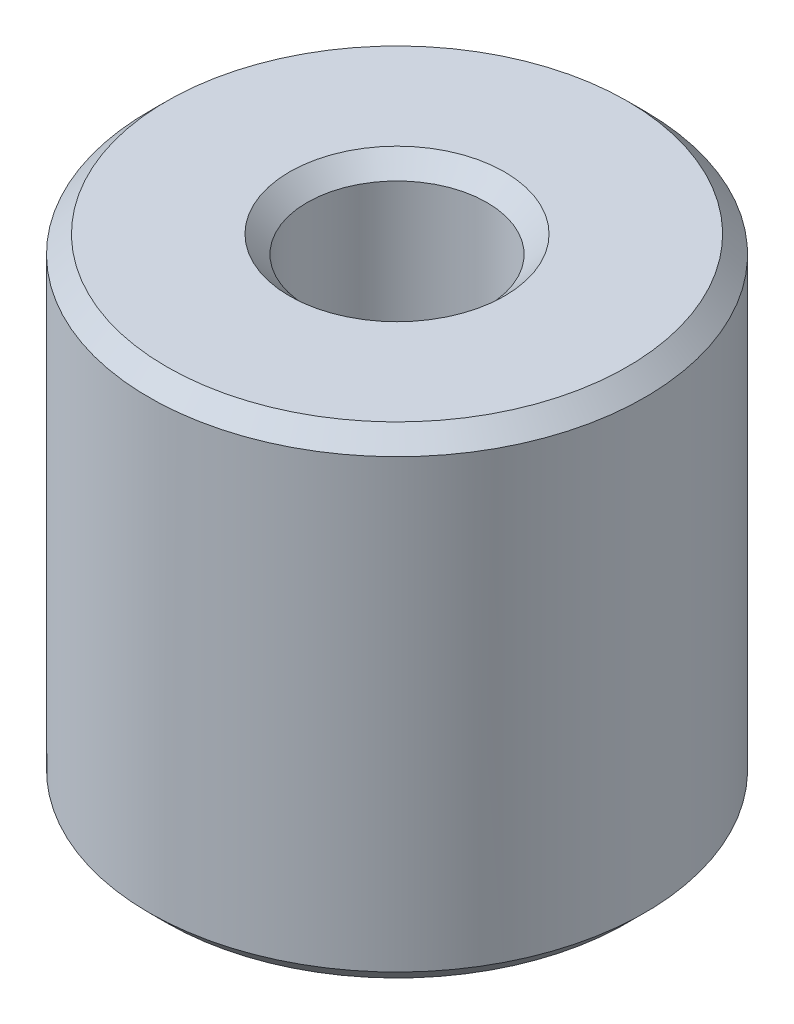
ISO-10303-21;
HEADER;
FILE_DESCRIPTION(('STEP AP214'),'2;1');
FILE_NAME('part.step','',(''),(''),'','','');
FILE_SCHEMA(('AUTOMOTIVE_DESIGN { 1 0 10303 214 1 1 1 1 }'));
ENDSEC;
DATA;
#1=APPLICATION_CONTEXT('core data for automotive mechanical design processes');
#2=APPLICATION_PROTOCOL_DEFINITION('international standard','automotive_design',2000,#1);
#3=PRODUCT_CONTEXT('',#1,'mechanical');
#4=PRODUCT('Part','Part','',(#3));
#5=PRODUCT_RELATED_PRODUCT_CATEGORY('part','',(#4));
#6=PRODUCT_DEFINITION_FORMATION('','',#4);
#7=PRODUCT_DEFINITION_CONTEXT('part definition',#1,'design');
#8=PRODUCT_DEFINITION('design','',#6,#7);
#9=PRODUCT_DEFINITION_SHAPE('','',#8);
#10=(LENGTH_UNIT() NAMED_UNIT(*) SI_UNIT(.MILLI.,.METRE.));
#11=(NAMED_UNIT(*) PLANE_ANGLE_UNIT() SI_UNIT($,.RADIAN.));
#12=(NAMED_UNIT(*) SI_UNIT($,.STERADIAN.) SOLID_ANGLE_UNIT());
#13=UNCERTAINTY_MEASURE_WITH_UNIT(LENGTH_MEASURE(1.E-05),#10,'distance_accuracy_value','');
#14=(GEOMETRIC_REPRESENTATION_CONTEXT(3) GLOBAL_UNCERTAINTY_ASSIGNED_CONTEXT((#13)) GLOBAL_UNIT_ASSIGNED_CONTEXT((#10,
#11,#12)) REPRESENTATION_CONTEXT('',''));
#15=CARTESIAN_POINT('',(0.,0.,0.));
#16=DIRECTION('',(0.,0.,1.));
#17=DIRECTION('',(1.,0.,0.));
#18=AXIS2_PLACEMENT_3D('',#15,#16,#17);
#19=CARTESIAN_POINT('',(0.,29.1415438561672,0.));
#20=DIRECTION('',(0.,-1.,0.));
#21=DIRECTION('',(0.,0.,-1.));
#22=AXIS2_PLACEMENT_3D('',#19,#20,#21);
#23=CYLINDRICAL_SURFACE('',#22,15.);
#24=CARTESIAN_POINT('',(0.,1.06807664097144,0.));
#25=DIRECTION('',(0.,1.,0.));
#26=DIRECTION('',(0.,0.,1.));
#27=AXIS2_PLACEMENT_3D('',#24,#25,#26);
#28=CIRCLE('',#27,15.);
#29=CARTESIAN_POINT('',(0.,1.06807664097144,-15.));
#30=VERTEX_POINT('',#29);
#31=EDGE_CURVE('E10',#30,#30,#28,.T.);
#32=CARTESIAN_POINT('',(0.,28.0734672151958,0.));
#33=DIRECTION('',(0.,1.,0.));
#34=DIRECTION('',(0.,0.,1.));
#35=AXIS2_PLACEMENT_3D('',#32,#33,#34);
#36=CIRCLE('',#35,15.);
#37=CARTESIAN_POINT('',(0.,28.0734672151958,-15.));
#38=VERTEX_POINT('',#37);
#39=EDGE_CURVE('E50',#38,#38,#36,.F.);
#40=CARTESIAN_POINT('',(0.,1.06807664097144,-15.));
#41=CARTESIAN_POINT('',(0.,1.34938279278628,-15.));
#42=CARTESIAN_POINT('',(0.,1.63068894460111,-15.));
#43=CARTESIAN_POINT('',(0.,2.19330124823079,-15.));
#44=CARTESIAN_POINT('',(0.,2.47460740004563,-15.));
#45=CARTESIAN_POINT('',(0.,3.0372197036753,-15.));
#46=CARTESIAN_POINT('',(0.,3.31852585549014,-15.));
#47=CARTESIAN_POINT('',(0.,3.88113815911981,-15.));
#48=CARTESIAN_POINT('',(0.,4.16244431093465,-15.));
#49=CARTESIAN_POINT('',(0.,4.72505661456433,-15.));
#50=CARTESIAN_POINT('',(0.,5.00636276637916,-15.));
#51=CARTESIAN_POINT('',(0.,5.56897507000884,-15.));
#52=CARTESIAN_POINT('',(0.,5.85028122182368,-15.));
#53=CARTESIAN_POINT('',(0.,6.41289352545335,-15.));
#54=CARTESIAN_POINT('',(0.,6.69419967726819,-15.));
#55=CARTESIAN_POINT('',(0.,7.25681198089786,-15.));
#56=CARTESIAN_POINT('',(0.,7.5381181327127,-15.));
#57=CARTESIAN_POINT('',(0.,8.10073043634238,-15.));
#58=CARTESIAN_POINT('',(0.,8.38203658815721,-15.));
#59=CARTESIAN_POINT('',(0.,8.94464889178689,-15.));
#60=CARTESIAN_POINT('',(0.,9.22595504360173,-15.));
#61=CARTESIAN_POINT('',(0.,9.7885673472314,-15.));
#62=CARTESIAN_POINT('',(0.,10.0698734990462,-15.));
#63=CARTESIAN_POINT('',(0.,10.6324858026759,-15.));
#64=CARTESIAN_POINT('',(0.,10.9137919544908,-15.));
#65=CARTESIAN_POINT('',(0.,11.4764042581204,-15.));
#66=CARTESIAN_POINT('',(0.,11.7577104099353,-15.));
#67=CARTESIAN_POINT('',(0.,12.3203227135649,-15.));
#68=CARTESIAN_POINT('',(0.,12.6016288653798,-15.));
#69=CARTESIAN_POINT('',(0.,13.1642411690095,-15.));
#70=CARTESIAN_POINT('',(0.,13.4455473208243,-15.));
#71=CARTESIAN_POINT('',(0.,14.008159624454,-15.));
#72=CARTESIAN_POINT('',(0.,14.2894657762688,-15.));
#73=CARTESIAN_POINT('',(0.,14.8520780798985,-15.));
#74=CARTESIAN_POINT('',(0.,15.1333842317133,-15.));
#75=CARTESIAN_POINT('',(0.,15.695996535343,-15.));
#76=CARTESIAN_POINT('',(0.,15.9773026871578,-15.));
#77=CARTESIAN_POINT('',(0.,16.5399149907875,-15.));
#78=CARTESIAN_POINT('',(0.,16.8212211426023,-15.));
#79=CARTESIAN_POINT('',(0.,17.383833446232,-15.));
#80=CARTESIAN_POINT('',(0.,17.6651395980469,-15.));
#81=CARTESIAN_POINT('',(0.,18.2277519016765,-15.));
#82=CARTESIAN_POINT('',(0.,18.5090580534914,-15.));
#83=CARTESIAN_POINT('',(0.,19.071670357121,-15.));
#84=CARTESIAN_POINT('',(0.,19.3529765089359,-15.));
#85=CARTESIAN_POINT('',(0.,19.9155888125656,-15.));
#86=CARTESIAN_POINT('',(0.,20.1968949643804,-15.));
#87=CARTESIAN_POINT('',(0.,20.7595072680101,-15.));
#88=CARTESIAN_POINT('',(0.,21.0408134198249,-15.));
#89=CARTESIAN_POINT('',(0.,21.6034257234546,-15.));
#90=CARTESIAN_POINT('',(0.,21.8847318752694,-15.));
#91=CARTESIAN_POINT('',(0.,22.4473441788991,-15.));
#92=CARTESIAN_POINT('',(0.,22.7286503307139,-15.));
#93=CARTESIAN_POINT('',(0.,23.2912626343436,-15.));
#94=CARTESIAN_POINT('',(0.,23.5725687861584,-15.));
#95=CARTESIAN_POINT('',(0.,24.1351810897881,-15.));
#96=CARTESIAN_POINT('',(0.,24.416487241603,-15.));
#97=CARTESIAN_POINT('',(0.,24.9790995452326,-15.));
#98=CARTESIAN_POINT('',(0.,25.2604056970475,-15.));
#99=CARTESIAN_POINT('',(0.,25.8230180006771,-15.));
#100=CARTESIAN_POINT('',(0.,26.104324152492,-15.));
#101=CARTESIAN_POINT('',(0.,26.6669364561217,-15.));
#102=CARTESIAN_POINT('',(0.,26.9482426079365,-15.));
#103=CARTESIAN_POINT('',(0.,27.5108549115662,-15.));
#104=CARTESIAN_POINT('',(0.,27.792161063381,-15.));
#105=CARTESIAN_POINT('',(0.,28.0734672151958,-15.));
#106=B_SPLINE_CURVE_WITH_KNOTS('',3,(#40,#41,#42,#43,#44,#45,#46,#47,#48,#49,#50,#51,#52,#53,
#54,#55,#56,#57,#58,#59,#60,#61,#62,#63,#64,#65,#66,#67,#68,#69,#70,#71,#72,#73,#74,#75,#76,#77,
#78,#79,#80,#81,#82,#83,#84,#85,#86,#87,#88,#89,#90,#91,#92,#93,#94,#95,#96,#97,#98,#99,#100,
#101,#102,#103,#104,#105),.UNSPECIFIED.,.F.,.F.,(4,2,2,2,2,2,2,2,2,2,2,2,2,2,2,2,2,2,2,2,2,2,2,
2,2,2,2,2,2,2,2,2,4),(0.,0.843918455444514,1.68783691088903,2.53175536633354,3.37567382177805,
4.21959227722257,5.06351073266708,5.90742918811159,6.7513476435561,7.59526609900062,
8.43918455444513,9.28310300988964,10.1270214653342,10.9709399207787,11.8148583762232,
12.6587768316677,13.5026952871122,14.3466137425567,15.1905321980012,16.0344506534457,
16.8783691088903,17.7222875643348,18.5662060197793,19.4101244752238,20.2540429306683,
21.0979613861128,21.9418798415573,22.7857982970018,23.6297167524464,24.4736352078909,
25.3175536633354,26.1614721187799,27.0053905742244),.UNSPECIFIED.);
#107=EDGE_CURVE('BSEAM39',#30,#38,#106,.T.);
#108=ORIENTED_EDGE('',*,*,#31,.T.);
#109=ORIENTED_EDGE('',*,*,#39,.T.);
#110=ORIENTED_EDGE('',*,*,#107,.T.);
#111=ORIENTED_EDGE('',*,*,#107,.F.);
#112=EDGE_LOOP('',(#108,#110,#109,#111));
#113=FACE_BOUND('',#112,.T.);
#114=ADVANCED_FACE('F39',(#113),#23,.T.);
#115=CARTESIAN_POINT('',(0.,29.1415438561672,0.));
#116=DIRECTION('',(0.,1.,0.));
#117=DIRECTION('',(0.,0.,1.));
#118=AXIS2_PLACEMENT_3D('',#115,#116,#117);
#119=PLANE('',#118);
#120=CARTESIAN_POINT('',(0.,29.1415438561672,0.));
#121=DIRECTION('',(0.,1.,0.));
#122=DIRECTION('',(0.,0.,1.));
#123=AXIS2_PLACEMENT_3D('',#120,#121,#122);
#124=CIRCLE('',#123,6.507497759652);
#125=CARTESIAN_POINT('',(0.,29.1415438561672,6.507497759652));
#126=VERTEX_POINT('',#125);
#127=EDGE_CURVE('E58',#126,#126,#124,.F.);
#128=ORIENTED_EDGE('',*,*,#127,.T.);
#129=EDGE_LOOP('',(#128));
#130=FACE_BOUND('',#129,.T.);
#131=CARTESIAN_POINT('',(0.,29.1415438561672,0.));
#132=DIRECTION('',(0.,1.,0.));
#133=DIRECTION('',(0.,0.,1.));
#134=AXIS2_PLACEMENT_3D('',#131,#132,#133);
#135=CIRCLE('',#134,13.9319233590286);
#136=CARTESIAN_POINT('',(0.,29.1415438561672,13.9319233590286));
#137=VERTEX_POINT('',#136);
#138=EDGE_CURVE('E61',#137,#137,#135,.T.);
#139=ORIENTED_EDGE('',*,*,#138,.T.);
#140=EDGE_LOOP('',(#139));
#141=FACE_BOUND('',#140,.T.);
#142=ADVANCED_FACE('F88',(#130,#141),#119,.T.);
#143=CARTESIAN_POINT('',(0.,0.,0.));
#144=DIRECTION('',(0.,1.,0.));
#145=DIRECTION('',(0.,0.,1.));
#146=AXIS2_PLACEMENT_3D('',#143,#144,#145);
#147=PLANE('',#146);
#148=CARTESIAN_POINT('',(0.,0.,0.));
#149=DIRECTION('',(0.,1.,0.));
#150=DIRECTION('',(0.,0.,1.));
#151=AXIS2_PLACEMENT_3D('',#148,#149,#150);
#152=CIRCLE('',#151,6.50749775965196);
#153=CARTESIAN_POINT('',(0.,0.,6.50749775965196));
#154=VERTEX_POINT('',#153);
#155=EDGE_CURVE('E51',#154,#154,#152,.T.);
#156=ORIENTED_EDGE('',*,*,#155,.T.);
#157=EDGE_LOOP('',(#156));
#158=FACE_BOUND('',#157,.T.);
#159=CARTESIAN_POINT('',(0.,0.,0.));
#160=DIRECTION('',(0.,1.,0.));
#161=DIRECTION('',(0.,0.,1.));
#162=AXIS2_PLACEMENT_3D('',#159,#160,#161);
#163=CIRCLE('',#162,13.9319233590286);
#164=CARTESIAN_POINT('',(0.,0.,13.9319233590286));
#165=VERTEX_POINT('',#164);
#166=EDGE_CURVE('E54',#165,#165,#163,.F.);
#167=ORIENTED_EDGE('',*,*,#166,.T.);
#168=EDGE_LOOP('',(#167));
#169=FACE_BOUND('',#168,.T.);
#170=ADVANCED_FACE('F83',(#158,#169),#147,.F.);
#171=CARTESIAN_POINT('',(0.,29.1415438561672,0.));
#172=DIRECTION('',(0.,-1.,0.));
#173=DIRECTION('',(0.,0.,-1.));
#174=AXIS2_PLACEMENT_3D('',#171,#172,#173);
#175=CYLINDRICAL_SURFACE('',#174,5.43942111868056);
#176=CARTESIAN_POINT('',(0.,28.0734672151958,0.));
#177=DIRECTION('',(0.,1.,0.));
#178=DIRECTION('',(0.,0.,1.));
#179=AXIS2_PLACEMENT_3D('',#176,#177,#178);
#180=CIRCLE('',#179,5.43942111868056);
#181=CARTESIAN_POINT('',(0.,28.0734672151958,-5.43942111868056));
#182=VERTEX_POINT('',#181);
#183=EDGE_CURVE('E67',#182,#182,#180,.T.);
#184=CARTESIAN_POINT('',(0.,1.06807664097141,0.));
#185=DIRECTION('',(0.,1.,0.));
#186=DIRECTION('',(0.,0.,1.));
#187=AXIS2_PLACEMENT_3D('',#184,#185,#186);
#188=CIRCLE('',#187,5.43942111868056);
#189=CARTESIAN_POINT('',(0.,1.0680766409714,-5.43942111868056));
#190=VERTEX_POINT('',#189);
#191=EDGE_CURVE('E69',#190,#190,#188,.F.);
#192=CARTESIAN_POINT('',(0.,28.0734672151958,-5.43942111868056));
#193=CARTESIAN_POINT('',(0.,27.792161063381,-5.43942111868056));
#194=CARTESIAN_POINT('',(0.,27.5108549115661,-5.43942111868056));
#195=CARTESIAN_POINT('',(0.,26.9482426079365,-5.43942111868056));
#196=CARTESIAN_POINT('',(0.,26.6669364561216,-5.43942111868056));
#197=CARTESIAN_POINT('',(0.,26.104324152492,-5.43942111868056));
#198=CARTESIAN_POINT('',(0.,25.8230180006771,-5.43942111868056));
#199=CARTESIAN_POINT('',(0.,25.2604056970474,-5.43942111868056));
#200=CARTESIAN_POINT('',(0.,24.9790995452326,-5.43942111868056));
#201=CARTESIAN_POINT('',(0.,24.4164872416029,-5.43942111868056));
#202=CARTESIAN_POINT('',(0.,24.1351810897881,-5.43942111868056));
#203=CARTESIAN_POINT('',(0.,23.5725687861584,-5.43942111868056));
#204=CARTESIAN_POINT('',(0.,23.2912626343436,-5.43942111868056));
#205=CARTESIAN_POINT('',(0.,22.7286503307139,-5.43942111868056));
#206=CARTESIAN_POINT('',(0.,22.4473441788991,-5.43942111868056));
#207=CARTESIAN_POINT('',(0.,21.8847318752694,-5.43942111868056));
#208=CARTESIAN_POINT('',(0.,21.6034257234545,-5.43942111868056));
#209=CARTESIAN_POINT('',(0.,21.0408134198249,-5.43942111868056));
#210=CARTESIAN_POINT('',(0.,20.75950726801,-5.43942111868056));
#211=CARTESIAN_POINT('',(0.,20.1968949643804,-5.43942111868056));
#212=CARTESIAN_POINT('',(0.,19.9155888125655,-5.43942111868056));
#213=CARTESIAN_POINT('',(0.,19.3529765089358,-5.43942111868056));
#214=CARTESIAN_POINT('',(0.,19.071670357121,-5.43942111868056));
#215=CARTESIAN_POINT('',(0.,18.5090580534913,-5.43942111868056));
#216=CARTESIAN_POINT('',(0.,18.2277519016765,-5.43942111868056));
#217=CARTESIAN_POINT('',(0.,17.6651395980468,-5.43942111868056));
#218=CARTESIAN_POINT('',(0.,17.383833446232,-5.43942111868056));
#219=CARTESIAN_POINT('',(0.,16.8212211426023,-5.43942111868056));
#220=CARTESIAN_POINT('',(0.,16.5399149907875,-5.43942111868056));
#221=CARTESIAN_POINT('',(0.,15.9773026871578,-5.43942111868056));
#222=CARTESIAN_POINT('',(0.,15.695996535343,-5.43942111868056));
#223=CARTESIAN_POINT('',(0.,15.1333842317133,-5.43942111868056));
#224=CARTESIAN_POINT('',(0.,14.8520780798984,-5.43942111868056));
#225=CARTESIAN_POINT('',(0.,14.2894657762688,-5.43942111868056));
#226=CARTESIAN_POINT('',(0.,14.0081596244539,-5.43942111868056));
#227=CARTESIAN_POINT('',(0.,13.4455473208243,-5.43942111868056));
#228=CARTESIAN_POINT('',(0.,13.1642411690094,-5.43942111868056));
#229=CARTESIAN_POINT('',(0.,12.6016288653797,-5.43942111868056));
#230=CARTESIAN_POINT('',(0.,12.3203227135649,-5.43942111868056));
#231=CARTESIAN_POINT('',(0.,11.7577104099352,-5.43942111868056));
#232=CARTESIAN_POINT('',(0.,11.4764042581204,-5.43942111868056));
#233=CARTESIAN_POINT('',(0.,10.9137919544907,-5.43942111868056));
#234=CARTESIAN_POINT('',(0.,10.6324858026759,-5.43942111868056));
#235=CARTESIAN_POINT('',(0.,10.0698734990462,-5.43942111868056));
#236=CARTESIAN_POINT('',(0.,9.78856734723137,-5.43942111868056));
#237=CARTESIAN_POINT('',(0.,9.22595504360169,-5.43942111868056));
#238=CARTESIAN_POINT('',(0.,8.94464889178686,-5.43942111868056));
#239=CARTESIAN_POINT('',(0.,8.38203658815718,-5.43942111868056));
#240=CARTESIAN_POINT('',(0.,8.10073043634234,-5.43942111868056));
#241=CARTESIAN_POINT('',(0.,7.53811813271267,-5.43942111868056));
#242=CARTESIAN_POINT('',(0.,7.25681198089783,-5.43942111868056));
#243=CARTESIAN_POINT('',(0.,6.69419967726815,-5.43942111868056));
#244=CARTESIAN_POINT('',(0.,6.41289352545331,-5.43942111868056));
#245=CARTESIAN_POINT('',(0.,5.85028122182364,-5.43942111868056));
#246=CARTESIAN_POINT('',(0.,5.5689750700088,-5.43942111868056));
#247=CARTESIAN_POINT('',(0.,5.00636276637913,-5.43942111868056));
#248=CARTESIAN_POINT('',(0.,4.72505661456429,-5.43942111868056));
#249=CARTESIAN_POINT('',(0.,4.16244431093462,-5.43942111868056));
#250=CARTESIAN_POINT('',(0.,3.88113815911978,-5.43942111868056));
#251=CARTESIAN_POINT('',(0.,3.3185258554901,-5.43942111868056));
#252=CARTESIAN_POINT('',(0.,3.03721970367526,-5.43942111868056));
#253=CARTESIAN_POINT('',(0.,2.47460740004559,-5.43942111868056));
#254=CARTESIAN_POINT('',(0.,2.19330124823075,-5.43942111868056));
#255=CARTESIAN_POINT('',(0.,1.63068894460108,-5.43942111868056));
#256=CARTESIAN_POINT('',(0.,1.34938279278624,-5.43942111868056));
#257=CARTESIAN_POINT('',(0.,1.0680766409714,-5.43942111868056));
#258=B_SPLINE_CURVE_WITH_KNOTS('',3,(#192,#193,#194,#195,#196,#197,#198,#199,#200,#201,#202,
#203,#204,#205,#206,#207,#208,#209,#210,#211,#212,#213,#214,#215,#216,#217,#218,#219,#220,#221,
#222,#223,#224,#225,#226,#227,#228,#229,#230,#231,#232,#233,#234,#235,#236,#237,#238,#239,#240,
#241,#242,#243,#244,#245,#246,#247,#248,#249,#250,#251,#252,#253,#254,#255,#256,#257),
.UNSPECIFIED.,.F.,.F.,(4,2,2,2,2,2,2,2,2,2,2,2,2,2,2,2,2,2,2,2,2,2,2,2,2,2,2,2,2,2,2,2,4),(0.,
0.843918455444514,1.68783691088903,2.53175536633354,3.37567382177805,4.21959227722257,
5.06351073266708,5.90742918811159,6.75134764355611,7.59526609900062,8.43918455444513,
9.28310300988964,10.1270214653342,10.9709399207787,11.8148583762232,12.6587768316677,
13.5026952871122,14.3466137425567,15.1905321980012,16.0344506534457,16.8783691088903,
17.7222875643348,18.5662060197793,19.4101244752238,20.2540429306683,21.0979613861128,
21.9418798415573,22.7857982970018,23.6297167524464,24.4736352078909,25.3175536633354,
26.1614721187799,27.0053905742244),.UNSPECIFIED.);
#259=EDGE_CURVE('BSEAM71',#182,#190,#258,.T.);
#260=ORIENTED_EDGE('',*,*,#183,.T.);
#261=ORIENTED_EDGE('',*,*,#191,.T.);
#262=ORIENTED_EDGE('',*,*,#259,.T.);
#263=ORIENTED_EDGE('',*,*,#259,.F.);
#264=EDGE_LOOP('',(#260,#262,#261,#263));
#265=FACE_BOUND('',#264,.T.);
#266=ADVANCED_FACE('F71',(#265),#175,.F.);
#267=CARTESIAN_POINT('',(0.,28.0734672151958,0.));
#268=DIRECTION('',(0.,1.,0.));
#269=DIRECTION('',(0.,0.,1.));
#270=AXIS2_PLACEMENT_3D('',#267,#268,#269);
#271=CONICAL_SURFACE('',#270,5.43942111868056,0.785398163397454);
#272=ORIENTED_EDGE('',*,*,#127,.F.);
#273=EDGE_LOOP('',(#272));
#274=FACE_BOUND('',#273,.T.);
#275=ORIENTED_EDGE('',*,*,#183,.F.);
#276=EDGE_LOOP('',(#275));
#277=FACE_BOUND('',#276,.T.);
#278=ADVANCED_FACE('F77',(#274,#277),#271,.F.);
#279=CARTESIAN_POINT('',(0.,0.,0.));
#280=DIRECTION('',(0.,-1.,0.));
#281=DIRECTION('',(0.,0.,-1.));
#282=AXIS2_PLACEMENT_3D('',#279,#280,#281);
#283=CONICAL_SURFACE('',#282,6.50749775965196,0.785398163397444);
#284=ORIENTED_EDGE('',*,*,#191,.F.);
#285=EDGE_LOOP('',(#284));
#286=FACE_BOUND('',#285,.T.);
#287=ORIENTED_EDGE('',*,*,#155,.F.);
#288=EDGE_LOOP('',(#287));
#289=FACE_BOUND('',#288,.T.);
#290=ADVANCED_FACE('F73',(#286,#289),#283,.F.);
#291=CARTESIAN_POINT('',(0.,1.06807664097144,0.));
#292=DIRECTION('',(0.,1.,0.));
#293=DIRECTION('',(0.,0.,1.));
#294=AXIS2_PLACEMENT_3D('',#291,#292,#293);
#295=CONICAL_SURFACE('',#294,15.,0.785398163397453);
#296=ORIENTED_EDGE('',*,*,#166,.F.);
#297=EDGE_LOOP('',(#296));
#298=FACE_BOUND('',#297,.T.);
#299=ORIENTED_EDGE('',*,*,#31,.F.);
#300=EDGE_LOOP('',(#299));
#301=FACE_BOUND('',#300,.T.);
#302=ADVANCED_FACE('F76',(#298,#301),#295,.T.);
#303=CARTESIAN_POINT('',(0.,29.1415438561672,0.));
#304=DIRECTION('',(0.,-1.,0.));
#305=DIRECTION('',(0.,0.,-1.));
#306=AXIS2_PLACEMENT_3D('',#303,#304,#305);
#307=CONICAL_SURFACE('',#306,13.9319233590286,0.785398163397444);
#308=ORIENTED_EDGE('',*,*,#39,.F.);
#309=EDGE_LOOP('',(#308));
#310=FACE_BOUND('',#309,.T.);
#311=ORIENTED_EDGE('',*,*,#138,.F.);
#312=EDGE_LOOP('',(#311));
#313=FACE_BOUND('',#312,.T.);
#314=ADVANCED_FACE('F45',(#310,#313),#307,.T.);
#315=CLOSED_SHELL('',(#114,#142,#170,#266,#278,#290,#302,#314));
#316=MANIFOLD_SOLID_BREP('B2',#315);
#317=ADVANCED_BREP_SHAPE_REPRESENTATION('',(#18,#316),#14);
#318=SHAPE_DEFINITION_REPRESENTATION(#9,#317);
ENDSEC;
END-ISO-10303-21;
